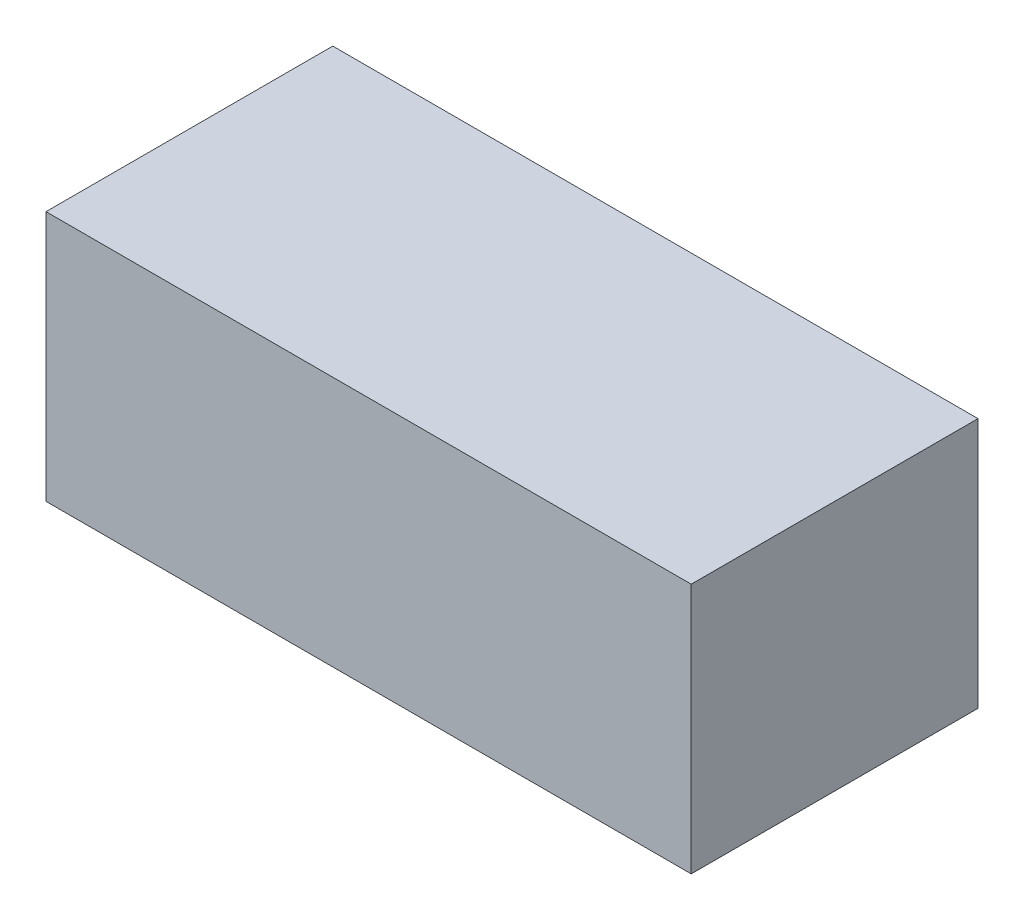
ISO-10303-21;
HEADER;
FILE_DESCRIPTION(('STEP AP214'),'2;1');
FILE_NAME('part.step','',(''),(''),'','','');
FILE_SCHEMA(('AUTOMOTIVE_DESIGN { 1 0 10303 214 1 1 1 1 }'));
ENDSEC;
DATA;
#1=APPLICATION_CONTEXT('core data for automotive mechanical design processes');
#2=APPLICATION_PROTOCOL_DEFINITION('international standard','automotive_design',2000,#1);
#3=PRODUCT_CONTEXT('',#1,'mechanical');
#4=PRODUCT('Part','Part','',(#3));
#5=PRODUCT_RELATED_PRODUCT_CATEGORY('part','',(#4));
#6=PRODUCT_DEFINITION_FORMATION('','',#4);
#7=PRODUCT_DEFINITION_CONTEXT('part definition',#1,'design');
#8=PRODUCT_DEFINITION('design','',#6,#7);
#9=PRODUCT_DEFINITION_SHAPE('','',#8);
#10=(LENGTH_UNIT() NAMED_UNIT(*) SI_UNIT(.MILLI.,.METRE.));
#11=(NAMED_UNIT(*) PLANE_ANGLE_UNIT() SI_UNIT($,.RADIAN.));
#12=(NAMED_UNIT(*) SI_UNIT($,.STERADIAN.) SOLID_ANGLE_UNIT());
#13=UNCERTAINTY_MEASURE_WITH_UNIT(LENGTH_MEASURE(1.E-05),#10,'distance_accuracy_value','');
#14=(GEOMETRIC_REPRESENTATION_CONTEXT(3) GLOBAL_UNCERTAINTY_ASSIGNED_CONTEXT((#13)) GLOBAL_UNIT_ASSIGNED_CONTEXT((#10,
#11,#12)) REPRESENTATION_CONTEXT('',''));
#15=CARTESIAN_POINT('',(0.,0.,0.));
#16=DIRECTION('',(0.,0.,1.));
#17=DIRECTION('',(1.,0.,0.));
#18=AXIS2_PLACEMENT_3D('',#15,#16,#17);
#19=CARTESIAN_POINT('',(-68.1822873812551,22.2068965517241,80.));
#20=DIRECTION('',(1.,0.,0.));
#21=DIRECTION('',(0.,0.,-1.));
#22=AXIS2_PLACEMENT_3D('',#19,#20,#21);
#23=PLANE('',#22);
#24=DIRECTION('',(0.,-1.,0.));
#25=VECTOR('',#24,1.);
#26=CARTESIAN_POINT('',(-68.1822873812551,22.2068965517241,0.));
#27=LINE('',#26,#25);
#28=CARTESIAN_POINT('',(-68.1822873812551,22.2068965517241,0.));
#29=VERTEX_POINT('',#28);
#30=CARTESIAN_POINT('',(-68.1822873812551,-47.7931034482759,0.));
#31=VERTEX_POINT('',#30);
#32=EDGE_CURVE('E107',#29,#31,#27,.T.);
#33=ORIENTED_EDGE('',*,*,#32,.T.);
#34=DIRECTION('',(0.,0.,-1.));
#35=VECTOR('',#34,1.);
#36=CARTESIAN_POINT('',(-68.1822873812551,-47.7931034482759,80.));
#37=LINE('',#36,#35);
#38=CARTESIAN_POINT('',(-68.1822873812551,-47.7931034482759,80.));
#39=VERTEX_POINT('',#38);
#40=EDGE_CURVE('E11',#39,#31,#37,.T.);
#41=ORIENTED_EDGE('',*,*,#40,.F.);
#42=DIRECTION('',(0.,-1.,0.));
#43=VECTOR('',#42,1.);
#44=CARTESIAN_POINT('',(-68.1822873812551,22.2068965517241,80.));
#45=LINE('',#44,#43);
#46=CARTESIAN_POINT('',(-68.1822873812551,22.2068965517241,80.));
#47=VERTEX_POINT('',#46);
#48=EDGE_CURVE('E91',#47,#39,#45,.T.);
#49=ORIENTED_EDGE('',*,*,#48,.F.);
#50=DIRECTION('',(0.,0.,-1.));
#51=VECTOR('',#50,1.);
#52=CARTESIAN_POINT('',(-68.1822873812551,22.2068965517241,80.));
#53=LINE('',#52,#51);
#54=EDGE_CURVE('E103',#47,#29,#53,.T.);
#55=ORIENTED_EDGE('',*,*,#54,.T.);
#56=EDGE_LOOP('',(#33,#41,#49,#55));
#57=FACE_BOUND('',#56,.T.);
#58=ADVANCED_FACE('F39',(#57),#23,.F.);
#59=CARTESIAN_POINT('',(-68.1822873812551,-47.7931034482759,80.));
#60=DIRECTION('',(0.,1.,0.));
#61=DIRECTION('',(0.,0.,1.));
#62=AXIS2_PLACEMENT_3D('',#59,#60,#61);
#63=PLANE('',#62);
#64=DIRECTION('',(1.,0.,0.));
#65=VECTOR('',#64,1.);
#66=CARTESIAN_POINT('',(-68.1822873812551,-47.7931034482759,0.));
#67=LINE('',#66,#65);
#68=CARTESIAN_POINT('',(111.817712618745,-47.7931034482759,0.));
#69=VERTEX_POINT('',#68);
#70=EDGE_CURVE('E96',#31,#69,#67,.T.);
#71=ORIENTED_EDGE('',*,*,#70,.T.);
#72=DIRECTION('',(0.,0.,-1.));
#73=VECTOR('',#72,1.);
#74=CARTESIAN_POINT('',(111.817712618745,-47.7931034482759,80.));
#75=LINE('',#74,#73);
#76=CARTESIAN_POINT('',(111.817712618745,-47.7931034482759,80.));
#77=VERTEX_POINT('',#76);
#78=EDGE_CURVE('E48',#77,#69,#75,.T.);
#79=ORIENTED_EDGE('',*,*,#78,.F.);
#80=DIRECTION('',(1.,0.,0.));
#81=VECTOR('',#80,1.);
#82=CARTESIAN_POINT('',(-68.1822873812551,-47.7931034482759,80.));
#83=LINE('',#82,#81);
#84=EDGE_CURVE('E86',#39,#77,#83,.T.);
#85=ORIENTED_EDGE('',*,*,#84,.F.);
#86=ORIENTED_EDGE('',*,*,#40,.T.);
#87=EDGE_LOOP('',(#71,#79,#85,#86));
#88=FACE_BOUND('',#87,.T.);
#89=ADVANCED_FACE('F95',(#88),#63,.F.);
#90=CARTESIAN_POINT('',(111.817712618745,22.2068965517241,80.));
#91=DIRECTION('',(-1.,0.,0.));
#92=DIRECTION('',(0.,0.,1.));
#93=AXIS2_PLACEMENT_3D('',#90,#91,#92);
#94=PLANE('',#93);
#95=DIRECTION('',(0.,1.,0.));
#96=VECTOR('',#95,1.);
#97=CARTESIAN_POINT('',(111.817712618745,22.2068965517241,0.));
#98=LINE('',#97,#96);
#99=CARTESIAN_POINT('',(111.817712618745,22.2068965517241,0.));
#100=VERTEX_POINT('',#99);
#101=EDGE_CURVE('E73',#69,#100,#98,.T.);
#102=ORIENTED_EDGE('',*,*,#101,.T.);
#103=DIRECTION('',(0.,0.,-1.));
#104=VECTOR('',#103,1.);
#105=CARTESIAN_POINT('',(111.817712618745,22.2068965517241,80.));
#106=LINE('',#105,#104);
#107=CARTESIAN_POINT('',(111.817712618745,22.2068965517241,80.));
#108=VERTEX_POINT('',#107);
#109=EDGE_CURVE('E98',#108,#100,#106,.T.);
#110=ORIENTED_EDGE('',*,*,#109,.F.);
#111=DIRECTION('',(0.,1.,0.));
#112=VECTOR('',#111,1.);
#113=CARTESIAN_POINT('',(111.817712618745,22.2068965517241,80.));
#114=LINE('',#113,#112);
#115=EDGE_CURVE('E89',#77,#108,#114,.T.);
#116=ORIENTED_EDGE('',*,*,#115,.F.);
#117=ORIENTED_EDGE('',*,*,#78,.T.);
#118=EDGE_LOOP('',(#102,#110,#116,#117));
#119=FACE_BOUND('',#118,.T.);
#120=ADVANCED_FACE('F99',(#119),#94,.F.);
#121=CARTESIAN_POINT('',(-68.1822873812551,22.2068965517241,80.));
#122=DIRECTION('',(0.,-1.,0.));
#123=DIRECTION('',(0.,0.,-1.));
#124=AXIS2_PLACEMENT_3D('',#121,#122,#123);
#125=PLANE('',#124);
#126=DIRECTION('',(-1.,0.,0.));
#127=VECTOR('',#126,1.);
#128=CARTESIAN_POINT('',(-68.1822873812551,22.2068965517241,0.));
#129=LINE('',#128,#127);
#130=EDGE_CURVE('E79',#100,#29,#129,.T.);
#131=ORIENTED_EDGE('',*,*,#130,.T.);
#132=ORIENTED_EDGE('',*,*,#54,.F.);
#133=DIRECTION('',(-1.,0.,0.));
#134=VECTOR('',#133,1.);
#135=CARTESIAN_POINT('',(-68.1822873812551,22.2068965517241,80.));
#136=LINE('',#135,#134);
#137=EDGE_CURVE('E56',#108,#47,#136,.T.);
#138=ORIENTED_EDGE('',*,*,#137,.F.);
#139=ORIENTED_EDGE('',*,*,#109,.T.);
#140=EDGE_LOOP('',(#131,#132,#138,#139));
#141=FACE_BOUND('',#140,.T.);
#142=ADVANCED_FACE('F120',(#141),#125,.F.);
#143=CARTESIAN_POINT('',(0.,0.,80.));
#144=DIRECTION('',(0.,0.,1.));
#145=DIRECTION('',(1.,0.,0.));
#146=AXIS2_PLACEMENT_3D('',#143,#144,#145);
#147=PLANE('',#146);
#148=ORIENTED_EDGE('',*,*,#48,.T.);
#149=ORIENTED_EDGE('',*,*,#84,.T.);
#150=ORIENTED_EDGE('',*,*,#115,.T.);
#151=ORIENTED_EDGE('',*,*,#137,.T.);
#152=EDGE_LOOP('',(#148,#149,#150,#151));
#153=FACE_BOUND('',#152,.T.);
#154=ADVANCED_FACE('F87',(#153),#147,.T.);
#155=CARTESIAN_POINT('',(0.,0.,0.));
#156=DIRECTION('',(0.,0.,1.));
#157=DIRECTION('',(1.,0.,0.));
#158=AXIS2_PLACEMENT_3D('',#155,#156,#157);
#159=PLANE('',#158);
#160=ORIENTED_EDGE('',*,*,#32,.F.);
#161=ORIENTED_EDGE('',*,*,#130,.F.);
#162=ORIENTED_EDGE('',*,*,#101,.F.);
#163=ORIENTED_EDGE('',*,*,#70,.F.);
#164=EDGE_LOOP('',(#160,#161,#162,#163));
#165=FACE_BOUND('',#164,.T.);
#166=ADVANCED_FACE('F123',(#165),#159,.F.);
#167=CLOSED_SHELL('',(#58,#89,#120,#142,#154,#166));
#168=MANIFOLD_SOLID_BREP('B2',#167);
#169=ADVANCED_BREP_SHAPE_REPRESENTATION('',(#18,#168),#14);
#170=SHAPE_DEFINITION_REPRESENTATION(#9,#169);
ENDSEC;
END-ISO-10303-21;
